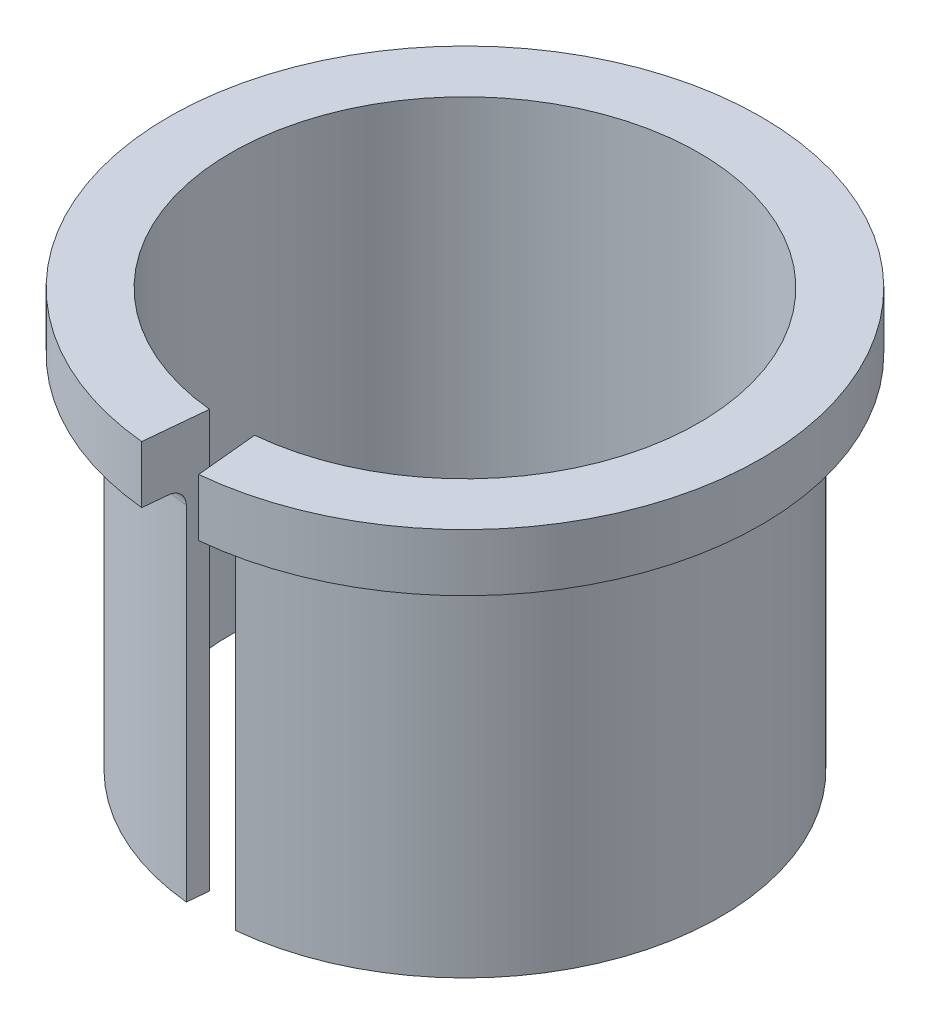
ISO-10303-21;
HEADER;
FILE_DESCRIPTION(('STEP AP214'),'2;1');
FILE_NAME('part.step','',(''),(''),'','','');
FILE_SCHEMA(('AUTOMOTIVE_DESIGN { 1 0 10303 214 1 1 1 1 }'));
ENDSEC;
DATA;
#1=APPLICATION_CONTEXT('core data for automotive mechanical design processes');
#2=APPLICATION_PROTOCOL_DEFINITION('international standard','automotive_design',2000,#1);
#3=PRODUCT_CONTEXT('',#1,'mechanical');
#4=PRODUCT('Part','Part','',(#3));
#5=PRODUCT_RELATED_PRODUCT_CATEGORY('part','',(#4));
#6=PRODUCT_DEFINITION_FORMATION('','',#4);
#7=PRODUCT_DEFINITION_CONTEXT('part definition',#1,'design');
#8=PRODUCT_DEFINITION('design','',#6,#7);
#9=PRODUCT_DEFINITION_SHAPE('','',#8);
#10=(LENGTH_UNIT() NAMED_UNIT(*) SI_UNIT(.MILLI.,.METRE.));
#11=(NAMED_UNIT(*) PLANE_ANGLE_UNIT() SI_UNIT($,.RADIAN.));
#12=(NAMED_UNIT(*) SI_UNIT($,.STERADIAN.) SOLID_ANGLE_UNIT());
#13=UNCERTAINTY_MEASURE_WITH_UNIT(LENGTH_MEASURE(1.E-05),#10,'distance_accuracy_value','');
#14=(GEOMETRIC_REPRESENTATION_CONTEXT(3) GLOBAL_UNCERTAINTY_ASSIGNED_CONTEXT((#13)) GLOBAL_UNIT_ASSIGNED_CONTEXT((#10,
#11,#12)) REPRESENTATION_CONTEXT('',''));
#15=CARTESIAN_POINT('',(0.,0.,0.));
#16=DIRECTION('',(0.,0.,1.));
#17=DIRECTION('',(1.,0.,0.));
#18=AXIS2_PLACEMENT_3D('',#15,#16,#17);
#19=CARTESIAN_POINT('',(0.,0.,0.));
#20=DIRECTION('',(0.,1.,0.));
#21=DIRECTION('',(0.,0.,1.));
#22=AXIS2_PLACEMENT_3D('',#19,#20,#21);
#23=PLANE('',#22);
#24=CARTESIAN_POINT('',(0.,0.,0.));
#25=DIRECTION('',(0.,1.,0.));
#26=DIRECTION('',(0.,0.,1.));
#27=AXIS2_PLACEMENT_3D('',#24,#25,#26);
#28=CIRCLE('',#27,15.6);
#29=CARTESIAN_POINT('',(1.50128659789421,0.,15.5275928125058));
#30=VERTEX_POINT('',#29);
#31=CARTESIAN_POINT('',(-1.50128659789421,0.,15.5275928125059));
#32=VERTEX_POINT('',#31);
#33=EDGE_CURVE('E134',#30,#32,#28,.T.);
#34=ORIENTED_EDGE('',*,*,#33,.F.);
#35=DIRECTION('',(-0.0962363203778342,0.,-0.99535851362217));
#36=VECTOR('',#35,1.);
#37=CARTESIAN_POINT('',(1.75,0.,18.1));
#38=LINE('',#37,#36);
#39=CARTESIAN_POINT('',(1.37617938140303,0.,14.233626744797));
#40=VERTEX_POINT('',#39);
#41=EDGE_CURVE('E117',#30,#40,#38,.T.);
#42=ORIENTED_EDGE('',*,*,#41,.T.);
#43=CARTESIAN_POINT('',(0.,0.,0.));
#44=DIRECTION('',(0.,1.,0.));
#45=DIRECTION('',(0.,0.,1.));
#46=AXIS2_PLACEMENT_3D('',#43,#44,#45);
#47=CIRCLE('',#46,14.3);
#48=CARTESIAN_POINT('',(-1.37617938140302,0.,14.233626744797));
#49=VERTEX_POINT('',#48);
#50=EDGE_CURVE('E131',#40,#49,#47,.T.);
#51=ORIENTED_EDGE('',*,*,#50,.T.);
#52=DIRECTION('',(-0.0962363203778339,0.,0.99535851362217));
#53=VECTOR('',#52,1.);
#54=CARTESIAN_POINT('',(0.,0.,0.));
#55=LINE('',#54,#53);
#56=EDGE_CURVE('E101',#49,#32,#55,.T.);
#57=ORIENTED_EDGE('',*,*,#56,.T.);
#58=EDGE_LOOP('',(#34,#42,#51,#57));
#59=FACE_BOUND('',#58,.T.);
#60=ADVANCED_FACE('F39',(#59),#23,.F.);
#61=CARTESIAN_POINT('',(0.,22.,0.));
#62=DIRECTION('',(0.,-1.,0.));
#63=DIRECTION('',(0.,0.,-1.));
#64=AXIS2_PLACEMENT_3D('',#61,#62,#63);
#65=CYLINDRICAL_SURFACE('',#64,15.6);
#66=CARTESIAN_POINT('',(0.,21.,0.));
#67=DIRECTION('',(0.,1.,0.));
#68=DIRECTION('',(0.,0.,1.));
#69=AXIS2_PLACEMENT_3D('',#66,#67,#68);
#70=CIRCLE('',#69,15.6);
#71=CARTESIAN_POINT('',(-1.50128659789421,21.,15.5275928125059));
#72=VERTEX_POINT('',#71);
#73=CARTESIAN_POINT('',(1.50128659789421,21.,15.5275928125059));
#74=VERTEX_POINT('',#73);
#75=EDGE_CURVE('E140',#72,#74,#70,.F.);
#76=ORIENTED_EDGE('',*,*,#75,.T.);
#77=DIRECTION('',(0.,-1.,0.));
#78=VECTOR('',#77,1.);
#79=CARTESIAN_POINT('',(1.50128659789421,22.,15.5275928125059));
#80=LINE('',#79,#78);
#81=EDGE_CURVE('E62',#74,#30,#80,.T.);
#82=ORIENTED_EDGE('',*,*,#81,.T.);
#83=ORIENTED_EDGE('',*,*,#33,.T.);
#84=DIRECTION('',(0.,-1.,0.));
#85=VECTOR('',#84,1.);
#86=CARTESIAN_POINT('',(-1.50128659789421,22.,15.5275928125059));
#87=LINE('',#86,#85);
#88=EDGE_CURVE('E162',#32,#72,#87,.F.);
#89=ORIENTED_EDGE('',*,*,#88,.T.);
#90=EDGE_LOOP('',(#76,#82,#83,#89));
#91=FACE_BOUND('',#90,.T.);
#92=ADVANCED_FACE('F164',(#91),#65,.T.);
#93=CARTESIAN_POINT('',(0.,22.,0.));
#94=DIRECTION('',(0.,-1.,0.));
#95=DIRECTION('',(0.,0.,-1.));
#96=AXIS2_PLACEMENT_3D('',#93,#94,#95);
#97=CYLINDRICAL_SURFACE('',#96,14.3);
#98=DIRECTION('',(0.,-1.,0.));
#99=VECTOR('',#98,1.);
#100=CARTESIAN_POINT('',(1.37617938140303,22.,14.233626744797));
#101=LINE('',#100,#99);
#102=CARTESIAN_POINT('',(1.37617938140303,25.5,14.233626744797));
#103=VERTEX_POINT('',#102);
#104=EDGE_CURVE('E122',#103,#40,#101,.T.);
#105=ORIENTED_EDGE('',*,*,#104,.F.);
#106=CARTESIAN_POINT('',(0.,25.5,0.));
#107=DIRECTION('',(0.,1.,0.));
#108=DIRECTION('',(0.,0.,1.));
#109=AXIS2_PLACEMENT_3D('',#106,#107,#108);
#110=CIRCLE('',#109,14.3);
#111=CARTESIAN_POINT('',(-1.37617938140302,25.5,14.233626744797));
#112=VERTEX_POINT('',#111);
#113=EDGE_CURVE('E114',#103,#112,#110,.T.);
#114=ORIENTED_EDGE('',*,*,#113,.T.);
#115=DIRECTION('',(0.,-1.,0.));
#116=VECTOR('',#115,1.);
#117=CARTESIAN_POINT('',(-1.37617938140302,22.,14.233626744797));
#118=LINE('',#117,#116);
#119=EDGE_CURVE('E95',#49,#112,#118,.F.);
#120=ORIENTED_EDGE('',*,*,#119,.F.);
#121=ORIENTED_EDGE('',*,*,#50,.F.);
#122=EDGE_LOOP('',(#105,#114,#120,#121));
#123=FACE_BOUND('',#122,.T.);
#124=ADVANCED_FACE('F121',(#123),#97,.F.);
#125=CARTESIAN_POINT('',(0.,25.5,0.));
#126=DIRECTION('',(0.,1.,0.));
#127=DIRECTION('',(0.,0.,1.));
#128=AXIS2_PLACEMENT_3D('',#125,#126,#127);
#129=PLANE('',#128);
#130=DIRECTION('',(-0.0962363203778342,0.,-0.99535851362217));
#131=VECTOR('',#130,1.);
#132=CARTESIAN_POINT('',(1.75,25.5,18.1));
#133=LINE('',#132,#131);
#134=CARTESIAN_POINT('',(1.7418773988388,25.5,18.0159890965613));
#135=VERTEX_POINT('',#134);
#136=EDGE_CURVE('E118',#135,#103,#133,.T.);
#137=ORIENTED_EDGE('',*,*,#136,.F.);
#138=CARTESIAN_POINT('',(0.,25.5,0.));
#139=DIRECTION('',(0.,1.,0.));
#140=DIRECTION('',(0.,0.,1.));
#141=AXIS2_PLACEMENT_3D('',#138,#139,#140);
#142=CIRCLE('',#141,18.1);
#143=CARTESIAN_POINT('',(-1.74187739883879,25.5,18.0159890965613));
#144=VERTEX_POINT('',#143);
#145=EDGE_CURVE('E116',#135,#144,#142,.T.);
#146=ORIENTED_EDGE('',*,*,#145,.T.);
#147=DIRECTION('',(-0.0962363203778339,0.,0.99535851362217));
#148=VECTOR('',#147,1.);
#149=CARTESIAN_POINT('',(0.,25.5,0.));
#150=LINE('',#149,#148);
#151=EDGE_CURVE('E98',#112,#144,#150,.T.);
#152=ORIENTED_EDGE('',*,*,#151,.F.);
#153=ORIENTED_EDGE('',*,*,#113,.F.);
#154=EDGE_LOOP('',(#137,#146,#152,#153));
#155=FACE_BOUND('',#154,.T.);
#156=ADVANCED_FACE('F113',(#155),#129,.T.);
#157=CARTESIAN_POINT('',(0.,22.,0.));
#158=DIRECTION('',(0.,1.,0.));
#159=DIRECTION('',(0.,0.,1.));
#160=AXIS2_PLACEMENT_3D('',#157,#158,#159);
#161=PLANE('',#160);
#162=CARTESIAN_POINT('',(0.,22.,0.));
#163=DIRECTION('',(0.,1.,0.));
#164=DIRECTION('',(0.,0.,1.));
#165=AXIS2_PLACEMENT_3D('',#162,#163,#164);
#166=CIRCLE('',#165,18.1);
#167=CARTESIAN_POINT('',(1.7418773988388,22.,18.0159890965613));
#168=VERTEX_POINT('',#167);
#169=CARTESIAN_POINT('',(-1.74187739883879,22.,18.0159890965613));
#170=VERTEX_POINT('',#169);
#171=EDGE_CURVE('E123',#168,#170,#166,.T.);
#172=ORIENTED_EDGE('',*,*,#171,.F.);
#173=DIRECTION('',(-0.0962363203778342,0.,-0.99535851362217));
#174=VECTOR('',#173,1.);
#175=CARTESIAN_POINT('',(0.,22.,0.));
#176=LINE('',#175,#174);
#177=CARTESIAN_POINT('',(1.59752291827205,22.,16.522951326128));
#178=VERTEX_POINT('',#177);
#179=EDGE_CURVE('E106',#168,#178,#176,.T.);
#180=ORIENTED_EDGE('',*,*,#179,.T.);
#181=CARTESIAN_POINT('',(0.,22.,0.));
#182=DIRECTION('',(0.,1.,0.));
#183=DIRECTION('',(0.,0.,1.));
#184=AXIS2_PLACEMENT_3D('',#181,#182,#183);
#185=CIRCLE('',#184,16.6);
#186=CARTESIAN_POINT('',(-1.59752291827204,22.,16.522951326128));
#187=VERTEX_POINT('',#186);
#188=EDGE_CURVE('E137',#178,#187,#185,.T.);
#189=ORIENTED_EDGE('',*,*,#188,.T.);
#190=DIRECTION('',(-0.096236320377834,0.,0.99535851362217));
#191=VECTOR('',#190,1.);
#192=CARTESIAN_POINT('',(0.,22.,0.));
#193=LINE('',#192,#191);
#194=EDGE_CURVE('E54',#187,#170,#193,.T.);
#195=ORIENTED_EDGE('',*,*,#194,.T.);
#196=EDGE_LOOP('',(#172,#180,#189,#195));
#197=FACE_BOUND('',#196,.T.);
#198=ADVANCED_FACE('F149',(#197),#161,.F.);
#199=CARTESIAN_POINT('',(0.,25.5,0.));
#200=DIRECTION('',(0.,-1.,0.));
#201=DIRECTION('',(0.,0.,-1.));
#202=AXIS2_PLACEMENT_3D('',#199,#200,#201);
#203=CYLINDRICAL_SURFACE('',#202,18.1);
#204=ORIENTED_EDGE('',*,*,#145,.F.);
#205=DIRECTION('',(0.,-1.,0.));
#206=VECTOR('',#205,1.);
#207=CARTESIAN_POINT('',(1.7418773988388,25.5,18.0159890965613));
#208=LINE('',#207,#206);
#209=EDGE_CURVE('E127',#135,#168,#208,.T.);
#210=ORIENTED_EDGE('',*,*,#209,.T.);
#211=ORIENTED_EDGE('',*,*,#171,.T.);
#212=DIRECTION('',(0.,-1.,0.));
#213=VECTOR('',#212,1.);
#214=CARTESIAN_POINT('',(-1.74187739883879,25.5,18.0159890965613));
#215=LINE('',#214,#213);
#216=EDGE_CURVE('E107',#170,#144,#215,.F.);
#217=ORIENTED_EDGE('',*,*,#216,.T.);
#218=EDGE_LOOP('',(#204,#210,#211,#217));
#219=FACE_BOUND('',#218,.T.);
#220=ADVANCED_FACE('F155',(#219),#203,.T.);
#221=CARTESIAN_POINT('',(0.,21.,0.));
#222=DIRECTION('',(0.,1.,0.));
#223=DIRECTION('',(0.,0.,1.));
#224=AXIS2_PLACEMENT_3D('',#221,#222,#223);
#225=TOROIDAL_SURFACE('',#224,16.6,1.);
#226=ORIENTED_EDGE('',*,*,#188,.F.);
#227=CARTESIAN_POINT('',(1.59752291827205,21.,16.522951326128));
#228=DIRECTION('',(0.99535851362217,0.,-0.0962363203778342));
#229=DIRECTION('',(-0.0962363203778342,0.,-0.99535851362217));
#230=AXIS2_PLACEMENT_3D('',#227,#228,#229);
#231=CIRCLE('',#230,1.);
#232=EDGE_CURVE('E11',#178,#74,#231,.F.);
#233=ORIENTED_EDGE('',*,*,#232,.T.);
#234=ORIENTED_EDGE('',*,*,#75,.F.);
#235=CARTESIAN_POINT('',(-1.59752291827204,21.,16.522951326128));
#236=DIRECTION('',(-0.99535851362217,0.,-0.096236320377834));
#237=DIRECTION('',(-0.096236320377834,0.,0.99535851362217));
#238=AXIS2_PLACEMENT_3D('',#235,#236,#237);
#239=CIRCLE('',#238,1.);
#240=EDGE_CURVE('E47',#72,#187,#239,.F.);
#241=ORIENTED_EDGE('',*,*,#240,.T.);
#242=EDGE_LOOP('',(#226,#233,#234,#241));
#243=FACE_BOUND('',#242,.T.);
#244=ADVANCED_FACE('F41',(#243),#225,.F.);
#245=CARTESIAN_POINT('',(0.,0.,0.));
#246=DIRECTION('',(-0.99535851362217,0.,-0.096236320377834));
#247=DIRECTION('',(-0.096236320377834,0.,0.99535851362217));
#248=AXIS2_PLACEMENT_3D('',#245,#246,#247);
#249=PLANE('',#248);
#250=ORIENTED_EDGE('',*,*,#119,.T.);
#251=ORIENTED_EDGE('',*,*,#151,.T.);
#252=ORIENTED_EDGE('',*,*,#216,.F.);
#253=ORIENTED_EDGE('',*,*,#194,.F.);
#254=ORIENTED_EDGE('',*,*,#240,.F.);
#255=ORIENTED_EDGE('',*,*,#88,.F.);
#256=ORIENTED_EDGE('',*,*,#56,.F.);
#257=EDGE_LOOP('',(#250,#251,#252,#253,#254,#255,#256));
#258=FACE_BOUND('',#257,.T.);
#259=ADVANCED_FACE('F97',(#258),#249,.F.);
#260=CARTESIAN_POINT('',(1.75,0.,18.1));
#261=DIRECTION('',(0.99535851362217,0.,-0.0962363203778342));
#262=DIRECTION('',(-0.0962363203778342,0.,-0.99535851362217));
#263=AXIS2_PLACEMENT_3D('',#260,#261,#262);
#264=PLANE('',#263);
#265=ORIENTED_EDGE('',*,*,#104,.T.);
#266=ORIENTED_EDGE('',*,*,#41,.F.);
#267=ORIENTED_EDGE('',*,*,#81,.F.);
#268=ORIENTED_EDGE('',*,*,#232,.F.);
#269=ORIENTED_EDGE('',*,*,#179,.F.);
#270=ORIENTED_EDGE('',*,*,#209,.F.);
#271=ORIENTED_EDGE('',*,*,#136,.T.);
#272=EDGE_LOOP('',(#265,#266,#267,#268,#269,#270,#271));
#273=FACE_BOUND('',#272,.T.);
#274=ADVANCED_FACE('F156',(#273),#264,.F.);
#275=CLOSED_SHELL('',(#60,#92,#124,#156,#198,#220,#244,#259,#274));
#276=MANIFOLD_SOLID_BREP('B2',#275);
#277=ADVANCED_BREP_SHAPE_REPRESENTATION('',(#18,#276),#14);
#278=SHAPE_DEFINITION_REPRESENTATION(#9,#277);
ENDSEC;
END-ISO-10303-21;
